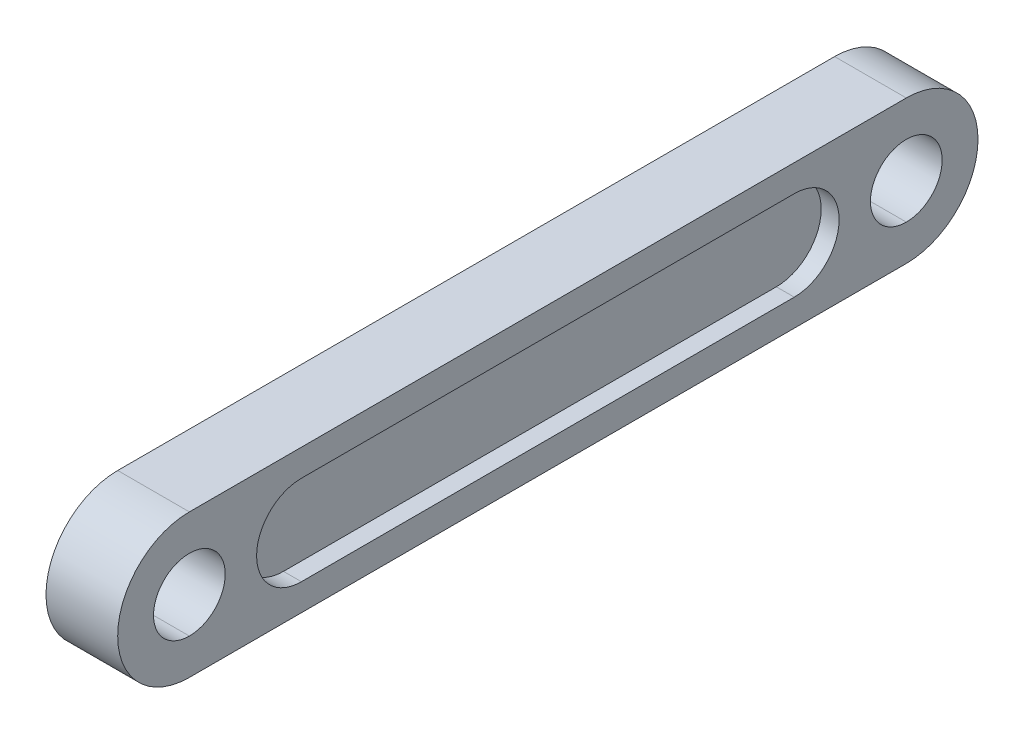
ISO-10303-21;
HEADER;
FILE_DESCRIPTION(('STEP AP214'),'2;1');
FILE_NAME('part.step','',(''),(''),'','','');
FILE_SCHEMA(('AUTOMOTIVE_DESIGN { 1 0 10303 214 1 1 1 1 }'));
ENDSEC;
DATA;
#1=APPLICATION_CONTEXT('core data for automotive mechanical design processes');
#2=APPLICATION_PROTOCOL_DEFINITION('international standard','automotive_design',2000,#1);
#3=PRODUCT_CONTEXT('',#1,'mechanical');
#4=PRODUCT('Part','Part','',(#3));
#5=PRODUCT_RELATED_PRODUCT_CATEGORY('part','',(#4));
#6=PRODUCT_DEFINITION_FORMATION('','',#4);
#7=PRODUCT_DEFINITION_CONTEXT('part definition',#1,'design');
#8=PRODUCT_DEFINITION('design','',#6,#7);
#9=PRODUCT_DEFINITION_SHAPE('','',#8);
#10=(LENGTH_UNIT() NAMED_UNIT(*) SI_UNIT(.MILLI.,.METRE.));
#11=(NAMED_UNIT(*) PLANE_ANGLE_UNIT() SI_UNIT($,.RADIAN.));
#12=(NAMED_UNIT(*) SI_UNIT($,.STERADIAN.) SOLID_ANGLE_UNIT());
#13=UNCERTAINTY_MEASURE_WITH_UNIT(LENGTH_MEASURE(1.E-05),#10,'distance_accuracy_value','');
#14=(GEOMETRIC_REPRESENTATION_CONTEXT(3) GLOBAL_UNCERTAINTY_ASSIGNED_CONTEXT((#13)) GLOBAL_UNIT_ASSIGNED_CONTEXT((#10,
#11,#12)) REPRESENTATION_CONTEXT('',''));
#15=CARTESIAN_POINT('',(0.,0.,0.));
#16=DIRECTION('',(0.,0.,1.));
#17=DIRECTION('',(1.,0.,0.));
#18=AXIS2_PLACEMENT_3D('',#15,#16,#17);
#19=CARTESIAN_POINT('',(4.,0.,0.));
#20=DIRECTION('',(1.,0.,0.));
#21=DIRECTION('',(0.,0.,-1.));
#22=AXIS2_PLACEMENT_3D('',#19,#20,#21);
#23=PLANE('',#22);
#24=CARTESIAN_POINT('',(4.,0.,-40.));
#25=DIRECTION('',(1.,0.,0.));
#26=DIRECTION('',(0.,0.,-1.));
#27=AXIS2_PLACEMENT_3D('',#24,#25,#26);
#28=CIRCLE('',#27,4.00000000000001);
#29=CARTESIAN_POINT('',(4.,4.00000000000001,-40.));
#30=VERTEX_POINT('',#29);
#31=CARTESIAN_POINT('',(4.,-4.,-40.));
#32=VERTEX_POINT('',#31);
#33=EDGE_CURVE('E222',#30,#32,#28,.F.);
#34=ORIENTED_EDGE('',*,*,#33,.T.);
#35=EDGE_CURVE('E226',#32,#30,#28,.F.);
#36=ORIENTED_EDGE('',*,*,#35,.T.);
#37=EDGE_LOOP('',(#34,#36));
#38=FACE_BOUND('',#37,.T.);
#39=CARTESIAN_POINT('',(4.,0.,40.));
#40=DIRECTION('',(1.,0.,0.));
#41=DIRECTION('',(0.,0.,-1.));
#42=AXIS2_PLACEMENT_3D('',#39,#40,#41);
#43=CIRCLE('',#42,4.00000000000001);
#44=CARTESIAN_POINT('',(4.,4.,40.));
#45=VERTEX_POINT('',#44);
#46=CARTESIAN_POINT('',(4.,-4.00000000000001,40.));
#47=VERTEX_POINT('',#46);
#48=EDGE_CURVE('E227',#45,#47,#43,.T.);
#49=ORIENTED_EDGE('',*,*,#48,.F.);
#50=EDGE_CURVE('E225',#47,#45,#43,.T.);
#51=ORIENTED_EDGE('',*,*,#50,.F.);
#52=EDGE_LOOP('',(#49,#51));
#53=FACE_BOUND('',#52,.T.);
#54=DIRECTION('',(0.,0.,-1.));
#55=VECTOR('',#54,1.);
#56=CARTESIAN_POINT('',(4.,-7.99999999999999,0.));
#57=LINE('',#56,#55);
#58=CARTESIAN_POINT('',(4.,-7.99999999999999,40.));
#59=VERTEX_POINT('',#58);
#60=CARTESIAN_POINT('',(4.,-7.99999999999999,-40.));
#61=VERTEX_POINT('',#60);
#62=EDGE_CURVE('E230',#59,#61,#57,.T.);
#63=ORIENTED_EDGE('',*,*,#62,.T.);
#64=CARTESIAN_POINT('',(4.,0.,-40.));
#65=DIRECTION('',(1.,0.,0.));
#66=DIRECTION('',(0.,0.,-1.));
#67=AXIS2_PLACEMENT_3D('',#64,#65,#66);
#68=CIRCLE('',#67,7.99999999999999);
#69=CARTESIAN_POINT('',(4.,7.99999999999998,-40.));
#70=VERTEX_POINT('',#69);
#71=EDGE_CURVE('E233',#61,#70,#68,.T.);
#72=ORIENTED_EDGE('',*,*,#71,.T.);
#73=DIRECTION('',(0.,0.,-1.));
#74=VECTOR('',#73,1.);
#75=CARTESIAN_POINT('',(4.,7.99999999999998,0.));
#76=LINE('',#75,#74);
#77=CARTESIAN_POINT('',(4.,7.99999999999998,40.));
#78=VERTEX_POINT('',#77);
#79=EDGE_CURVE('E235',#78,#70,#76,.T.);
#80=ORIENTED_EDGE('',*,*,#79,.F.);
#81=CARTESIAN_POINT('',(4.,0.,40.));
#82=DIRECTION('',(1.,0.,0.));
#83=DIRECTION('',(0.,0.,-1.));
#84=AXIS2_PLACEMENT_3D('',#81,#82,#83);
#85=CIRCLE('',#84,7.99999999999999);
#86=EDGE_CURVE('E238',#59,#78,#85,.F.);
#87=ORIENTED_EDGE('',*,*,#86,.F.);
#88=EDGE_LOOP('',(#63,#72,#80,#87));
#89=FACE_BOUND('',#88,.T.);
#90=DIRECTION('',(0.,0.,-1.));
#91=VECTOR('',#90,1.);
#92=CARTESIAN_POINT('',(4.,5.,-27.5));
#93=LINE('',#92,#91);
#94=CARTESIAN_POINT('',(4.,5.,27.5));
#95=VERTEX_POINT('',#94);
#96=CARTESIAN_POINT('',(4.,5.,-27.5));
#97=VERTEX_POINT('',#96);
#98=EDGE_CURVE('E182',#95,#97,#93,.T.);
#99=ORIENTED_EDGE('',*,*,#98,.T.);
#100=CARTESIAN_POINT('',(4.,0.,-27.5));
#101=DIRECTION('',(-1.,0.,0.));
#102=DIRECTION('',(0.,0.,1.));
#103=AXIS2_PLACEMENT_3D('',#100,#101,#102);
#104=CIRCLE('',#103,5.);
#105=CARTESIAN_POINT('',(4.,-5.,-27.5));
#106=VERTEX_POINT('',#105);
#107=EDGE_CURVE('E56',#97,#106,#104,.T.);
#108=ORIENTED_EDGE('',*,*,#107,.T.);
#109=DIRECTION('',(0.,0.,1.));
#110=VECTOR('',#109,1.);
#111=CARTESIAN_POINT('',(4.,-5.,-27.5));
#112=LINE('',#111,#110);
#113=CARTESIAN_POINT('',(4.,-4.99999999999999,27.5));
#114=VERTEX_POINT('',#113);
#115=EDGE_CURVE('E173',#106,#114,#112,.T.);
#116=ORIENTED_EDGE('',*,*,#115,.T.);
#117=CARTESIAN_POINT('',(4.,0.,27.5));
#118=DIRECTION('',(-1.,0.,0.));
#119=DIRECTION('',(0.,0.,1.));
#120=AXIS2_PLACEMENT_3D('',#117,#118,#119);
#121=CIRCLE('',#120,5.);
#122=EDGE_CURVE('E176',#114,#95,#121,.T.);
#123=ORIENTED_EDGE('',*,*,#122,.T.);
#124=EDGE_LOOP('',(#99,#108,#116,#123));
#125=FACE_BOUND('',#124,.T.);
#126=ADVANCED_FACE('F40',(#38,#53,#89,#125),#23,.T.);
#127=CARTESIAN_POINT('',(4.,0.,40.));
#128=DIRECTION('',(-1.,0.,0.));
#129=DIRECTION('',(0.,0.,1.));
#130=AXIS2_PLACEMENT_3D('',#127,#128,#129);
#131=CYLINDRICAL_SURFACE('',#130,4.00000000000001);
#132=ORIENTED_EDGE('',*,*,#48,.T.);
#133=DIRECTION('',(-1.,0.,0.));
#134=VECTOR('',#133,1.);
#135=CARTESIAN_POINT('',(4.,-4.00000000000001,40.));
#136=LINE('',#135,#134);
#137=CARTESIAN_POINT('',(-4.,-4.00000000000001,40.));
#138=VERTEX_POINT('',#137);
#139=EDGE_CURVE('E11',#47,#138,#136,.T.);
#140=ORIENTED_EDGE('',*,*,#139,.T.);
#141=CARTESIAN_POINT('',(-4.,0.,40.));
#142=DIRECTION('',(1.,0.,0.));
#143=DIRECTION('',(0.,0.,-1.));
#144=AXIS2_PLACEMENT_3D('',#141,#142,#143);
#145=CIRCLE('',#144,4.00000000000001);
#146=CARTESIAN_POINT('',(-4.,4.,40.));
#147=VERTEX_POINT('',#146);
#148=EDGE_CURVE('E246',#147,#138,#145,.T.);
#149=ORIENTED_EDGE('',*,*,#148,.F.);
#150=DIRECTION('',(-1.,0.,0.));
#151=VECTOR('',#150,1.);
#152=CARTESIAN_POINT('',(4.,4.,40.));
#153=LINE('',#152,#151);
#154=EDGE_CURVE('E49',#45,#147,#153,.T.);
#155=ORIENTED_EDGE('',*,*,#154,.F.);
#156=EDGE_LOOP('',(#132,#140,#149,#155));
#157=FACE_BOUND('',#156,.T.);
#158=ADVANCED_FACE('F287',(#157),#131,.F.);
#159=CARTESIAN_POINT('',(4.,0.,-40.));
#160=DIRECTION('',(-1.,0.,0.));
#161=DIRECTION('',(0.,0.,1.));
#162=AXIS2_PLACEMENT_3D('',#159,#160,#161);
#163=CYLINDRICAL_SURFACE('',#162,4.00000000000001);
#164=DIRECTION('',(-1.,0.,0.));
#165=VECTOR('',#164,1.);
#166=CARTESIAN_POINT('',(4.,-4.,-40.));
#167=LINE('',#166,#165);
#168=CARTESIAN_POINT('',(-4.,-4.,-40.));
#169=VERTEX_POINT('',#168);
#170=EDGE_CURVE('E273',#169,#32,#167,.F.);
#171=ORIENTED_EDGE('',*,*,#170,.F.);
#172=CARTESIAN_POINT('',(-4.,0.,-40.));
#173=DIRECTION('',(1.,0.,0.));
#174=DIRECTION('',(0.,0.,-1.));
#175=AXIS2_PLACEMENT_3D('',#172,#173,#174);
#176=CIRCLE('',#175,4.00000000000001);
#177=CARTESIAN_POINT('',(-4.,4.00000000000001,-40.));
#178=VERTEX_POINT('',#177);
#179=EDGE_CURVE('E216',#169,#178,#176,.F.);
#180=ORIENTED_EDGE('',*,*,#179,.T.);
#181=DIRECTION('',(-1.,0.,0.));
#182=VECTOR('',#181,1.);
#183=CARTESIAN_POINT('',(4.,4.00000000000001,-40.));
#184=LINE('',#183,#182);
#185=EDGE_CURVE('E269',#178,#30,#184,.F.);
#186=ORIENTED_EDGE('',*,*,#185,.T.);
#187=ORIENTED_EDGE('',*,*,#35,.F.);
#188=EDGE_LOOP('',(#171,#180,#186,#187));
#189=FACE_BOUND('',#188,.T.);
#190=ADVANCED_FACE('F359',(#189),#163,.F.);
#191=CARTESIAN_POINT('',(4.,-7.99999999999999,0.));
#192=DIRECTION('',(0.,1.,0.));
#193=DIRECTION('',(0.,0.,1.));
#194=AXIS2_PLACEMENT_3D('',#191,#192,#193);
#195=PLANE('',#194);
#196=DIRECTION('',(0.,0.,-1.));
#197=VECTOR('',#196,1.);
#198=CARTESIAN_POINT('',(-4.,-7.99999999999999,0.));
#199=LINE('',#198,#197);
#200=CARTESIAN_POINT('',(-4.,-7.99999999999999,40.));
#201=VERTEX_POINT('',#200);
#202=CARTESIAN_POINT('',(-4.,-7.99999999999999,-40.));
#203=VERTEX_POINT('',#202);
#204=EDGE_CURVE('E249',#201,#203,#199,.T.);
#205=ORIENTED_EDGE('',*,*,#204,.T.);
#206=DIRECTION('',(-1.,0.,0.));
#207=VECTOR('',#206,1.);
#208=CARTESIAN_POINT('',(4.,-7.99999999999999,-40.));
#209=LINE('',#208,#207);
#210=EDGE_CURVE('E266',#61,#203,#209,.T.);
#211=ORIENTED_EDGE('',*,*,#210,.F.);
#212=ORIENTED_EDGE('',*,*,#62,.F.);
#213=DIRECTION('',(-1.,0.,0.));
#214=VECTOR('',#213,1.);
#215=CARTESIAN_POINT('',(4.,-7.99999999999999,40.));
#216=LINE('',#215,#214);
#217=EDGE_CURVE('E241',#59,#201,#216,.T.);
#218=ORIENTED_EDGE('',*,*,#217,.T.);
#219=EDGE_LOOP('',(#205,#211,#212,#218));
#220=FACE_BOUND('',#219,.T.);
#221=ADVANCED_FACE('F310',(#220),#195,.F.);
#222=CARTESIAN_POINT('',(4.,0.,-40.));
#223=DIRECTION('',(-1.,0.,0.));
#224=DIRECTION('',(0.,0.,1.));
#225=AXIS2_PLACEMENT_3D('',#222,#223,#224);
#226=CYLINDRICAL_SURFACE('',#225,7.99999999999999);
#227=CARTESIAN_POINT('',(-4.,0.,-40.));
#228=DIRECTION('',(1.,0.,0.));
#229=DIRECTION('',(0.,0.,-1.));
#230=AXIS2_PLACEMENT_3D('',#227,#228,#229);
#231=CIRCLE('',#230,7.99999999999999);
#232=CARTESIAN_POINT('',(-4.,7.99999999999998,-40.));
#233=VERTEX_POINT('',#232);
#234=EDGE_CURVE('E252',#203,#233,#231,.T.);
#235=ORIENTED_EDGE('',*,*,#234,.T.);
#236=DIRECTION('',(-1.,0.,0.));
#237=VECTOR('',#236,1.);
#238=CARTESIAN_POINT('',(4.,7.99999999999998,-40.));
#239=LINE('',#238,#237);
#240=EDGE_CURVE('E264',#70,#233,#239,.T.);
#241=ORIENTED_EDGE('',*,*,#240,.F.);
#242=ORIENTED_EDGE('',*,*,#71,.F.);
#243=ORIENTED_EDGE('',*,*,#210,.T.);
#244=EDGE_LOOP('',(#235,#241,#242,#243));
#245=FACE_BOUND('',#244,.T.);
#246=ADVANCED_FACE('F309',(#245),#226,.T.);
#247=CARTESIAN_POINT('',(4.,7.99999999999998,0.));
#248=DIRECTION('',(0.,1.,0.));
#249=DIRECTION('',(0.,0.,1.));
#250=AXIS2_PLACEMENT_3D('',#247,#248,#249);
#251=PLANE('',#250);
#252=DIRECTION('',(0.,0.,-1.));
#253=VECTOR('',#252,1.);
#254=CARTESIAN_POINT('',(-4.,7.99999999999998,0.));
#255=LINE('',#254,#253);
#256=CARTESIAN_POINT('',(-4.,7.99999999999998,40.));
#257=VERTEX_POINT('',#256);
#258=EDGE_CURVE('E255',#257,#233,#255,.T.);
#259=ORIENTED_EDGE('',*,*,#258,.F.);
#260=DIRECTION('',(-1.,0.,0.));
#261=VECTOR('',#260,1.);
#262=CARTESIAN_POINT('',(4.,7.99999999999998,40.));
#263=LINE('',#262,#261);
#264=EDGE_CURVE('E262',#78,#257,#263,.T.);
#265=ORIENTED_EDGE('',*,*,#264,.F.);
#266=ORIENTED_EDGE('',*,*,#79,.T.);
#267=ORIENTED_EDGE('',*,*,#240,.T.);
#268=EDGE_LOOP('',(#259,#265,#266,#267));
#269=FACE_BOUND('',#268,.T.);
#270=ADVANCED_FACE('F306',(#269),#251,.T.);
#271=ORIENTED_EDGE('',*,*,#139,.F.);
#272=ORIENTED_EDGE('',*,*,#50,.T.);
#273=ORIENTED_EDGE('',*,*,#154,.T.);
#274=EDGE_CURVE('E245',#138,#147,#145,.T.);
#275=ORIENTED_EDGE('',*,*,#274,.F.);
#276=EDGE_LOOP('',(#271,#272,#273,#275));
#277=FACE_BOUND('',#276,.T.);
#278=ADVANCED_FACE('F283',(#277),#131,.F.);
#279=EDGE_CURVE('E242',#178,#169,#176,.F.);
#280=ORIENTED_EDGE('',*,*,#279,.T.);
#281=ORIENTED_EDGE('',*,*,#170,.T.);
#282=ORIENTED_EDGE('',*,*,#33,.F.);
#283=ORIENTED_EDGE('',*,*,#185,.F.);
#284=EDGE_LOOP('',(#280,#281,#282,#283));
#285=FACE_BOUND('',#284,.T.);
#286=ADVANCED_FACE('F42',(#285),#163,.F.);
#287=CARTESIAN_POINT('',(4.,0.,40.));
#288=DIRECTION('',(-1.,0.,0.));
#289=DIRECTION('',(0.,0.,1.));
#290=AXIS2_PLACEMENT_3D('',#287,#288,#289);
#291=CYLINDRICAL_SURFACE('',#290,7.99999999999999);
#292=CARTESIAN_POINT('',(-4.,0.,40.));
#293=DIRECTION('',(1.,0.,0.));
#294=DIRECTION('',(0.,0.,-1.));
#295=AXIS2_PLACEMENT_3D('',#292,#293,#294);
#296=CIRCLE('',#295,7.99999999999999);
#297=EDGE_CURVE('E258',#201,#257,#296,.F.);
#298=ORIENTED_EDGE('',*,*,#297,.F.);
#299=ORIENTED_EDGE('',*,*,#217,.F.);
#300=ORIENTED_EDGE('',*,*,#86,.T.);
#301=ORIENTED_EDGE('',*,*,#264,.T.);
#302=EDGE_LOOP('',(#298,#299,#300,#301));
#303=FACE_BOUND('',#302,.T.);
#304=ADVANCED_FACE('F293',(#303),#291,.T.);
#305=CARTESIAN_POINT('',(-4.,0.,0.));
#306=DIRECTION('',(1.,0.,0.));
#307=DIRECTION('',(0.,0.,-1.));
#308=AXIS2_PLACEMENT_3D('',#305,#306,#307);
#309=PLANE('',#308);
#310=DIRECTION('',(0.,0.,1.));
#311=VECTOR('',#310,1.);
#312=CARTESIAN_POINT('',(-4.,-5.,-27.5));
#313=LINE('',#312,#311);
#314=CARTESIAN_POINT('',(-4.,-5.,-27.5));
#315=VERTEX_POINT('',#314);
#316=CARTESIAN_POINT('',(-4.,-4.99999999999999,27.5));
#317=VERTEX_POINT('',#316);
#318=EDGE_CURVE('E206',#315,#317,#313,.T.);
#319=ORIENTED_EDGE('',*,*,#318,.F.);
#320=CARTESIAN_POINT('',(-4.,0.,-27.5));
#321=DIRECTION('',(-1.,0.,0.));
#322=DIRECTION('',(0.,0.,1.));
#323=AXIS2_PLACEMENT_3D('',#320,#321,#322);
#324=CIRCLE('',#323,5.);
#325=CARTESIAN_POINT('',(-4.,5.,-27.5));
#326=VERTEX_POINT('',#325);
#327=EDGE_CURVE('E64',#326,#315,#324,.T.);
#328=ORIENTED_EDGE('',*,*,#327,.F.);
#329=DIRECTION('',(0.,0.,-1.));
#330=VECTOR('',#329,1.);
#331=CARTESIAN_POINT('',(-4.,5.,-27.5));
#332=LINE('',#331,#330);
#333=CARTESIAN_POINT('',(-4.,5.,27.5));
#334=VERTEX_POINT('',#333);
#335=EDGE_CURVE('E195',#334,#326,#332,.T.);
#336=ORIENTED_EDGE('',*,*,#335,.F.);
#337=CARTESIAN_POINT('',(-4.,0.,27.5));
#338=DIRECTION('',(-1.,0.,0.));
#339=DIRECTION('',(0.,0.,1.));
#340=AXIS2_PLACEMENT_3D('',#337,#338,#339);
#341=CIRCLE('',#340,5.);
#342=EDGE_CURVE('E209',#317,#334,#341,.T.);
#343=ORIENTED_EDGE('',*,*,#342,.F.);
#344=EDGE_LOOP('',(#319,#328,#336,#343));
#345=FACE_BOUND('',#344,.T.);
#346=ORIENTED_EDGE('',*,*,#279,.F.);
#347=ORIENTED_EDGE('',*,*,#179,.F.);
#348=EDGE_LOOP('',(#346,#347));
#349=FACE_BOUND('',#348,.T.);
#350=ORIENTED_EDGE('',*,*,#148,.T.);
#351=ORIENTED_EDGE('',*,*,#274,.T.);
#352=EDGE_LOOP('',(#350,#351));
#353=FACE_BOUND('',#352,.T.);
#354=ORIENTED_EDGE('',*,*,#204,.F.);
#355=ORIENTED_EDGE('',*,*,#297,.T.);
#356=ORIENTED_EDGE('',*,*,#258,.T.);
#357=ORIENTED_EDGE('',*,*,#234,.F.);
#358=EDGE_LOOP('',(#354,#355,#356,#357));
#359=FACE_BOUND('',#358,.T.);
#360=ADVANCED_FACE('F289',(#345,#349,#353,#359),#309,.F.);
#361=CARTESIAN_POINT('',(-2.,0.,-27.5));
#362=DIRECTION('',(-1.,0.,0.));
#363=DIRECTION('',(0.,0.,1.));
#364=AXIS2_PLACEMENT_3D('',#361,#362,#363);
#365=CYLINDRICAL_SURFACE('',#364,5.);
#366=ORIENTED_EDGE('',*,*,#327,.T.);
#367=DIRECTION('',(-1.,0.,0.));
#368=VECTOR('',#367,1.);
#369=CARTESIAN_POINT('',(-2.,-5.,-27.5));
#370=LINE('',#369,#368);
#371=CARTESIAN_POINT('',(-2.,-5.,-27.5));
#372=VERTEX_POINT('',#371);
#373=EDGE_CURVE('E204',#372,#315,#370,.T.);
#374=ORIENTED_EDGE('',*,*,#373,.F.);
#375=CARTESIAN_POINT('',(-2.,0.,-27.5));
#376=DIRECTION('',(-1.,0.,0.));
#377=DIRECTION('',(0.,0.,1.));
#378=AXIS2_PLACEMENT_3D('',#375,#376,#377);
#379=CIRCLE('',#378,5.);
#380=CARTESIAN_POINT('',(-2.,5.,-27.5));
#381=VERTEX_POINT('',#380);
#382=EDGE_CURVE('E191',#381,#372,#379,.T.);
#383=ORIENTED_EDGE('',*,*,#382,.F.);
#384=DIRECTION('',(-1.,0.,0.));
#385=VECTOR('',#384,1.);
#386=CARTESIAN_POINT('',(-2.,5.,-27.5));
#387=LINE('',#386,#385);
#388=EDGE_CURVE('E214',#381,#326,#387,.T.);
#389=ORIENTED_EDGE('',*,*,#388,.T.);
#390=EDGE_LOOP('',(#366,#374,#383,#389));
#391=FACE_BOUND('',#390,.T.);
#392=ADVANCED_FACE('F292',(#391),#365,.F.);
#393=CARTESIAN_POINT('',(-2.,5.,-27.5));
#394=DIRECTION('',(0.,1.,0.));
#395=DIRECTION('',(0.,0.,1.));
#396=AXIS2_PLACEMENT_3D('',#393,#394,#395);
#397=PLANE('',#396);
#398=ORIENTED_EDGE('',*,*,#335,.T.);
#399=ORIENTED_EDGE('',*,*,#388,.F.);
#400=DIRECTION('',(0.,0.,-1.));
#401=VECTOR('',#400,1.);
#402=CARTESIAN_POINT('',(-2.,5.,-27.5));
#403=LINE('',#402,#401);
#404=CARTESIAN_POINT('',(-2.,5.,27.5));
#405=VERTEX_POINT('',#404);
#406=EDGE_CURVE('E201',#405,#381,#403,.T.);
#407=ORIENTED_EDGE('',*,*,#406,.F.);
#408=DIRECTION('',(-1.,0.,0.));
#409=VECTOR('',#408,1.);
#410=CARTESIAN_POINT('',(-2.,5.,27.5));
#411=LINE('',#410,#409);
#412=EDGE_CURVE('E217',#405,#334,#411,.T.);
#413=ORIENTED_EDGE('',*,*,#412,.T.);
#414=EDGE_LOOP('',(#398,#399,#407,#413));
#415=FACE_BOUND('',#414,.T.);
#416=ADVANCED_FACE('F339',(#415),#397,.F.);
#417=CARTESIAN_POINT('',(-2.,0.,27.5));
#418=DIRECTION('',(-1.,0.,0.));
#419=DIRECTION('',(0.,0.,1.));
#420=AXIS2_PLACEMENT_3D('',#417,#418,#419);
#421=CYLINDRICAL_SURFACE('',#420,5.);
#422=ORIENTED_EDGE('',*,*,#342,.T.);
#423=ORIENTED_EDGE('',*,*,#412,.F.);
#424=CARTESIAN_POINT('',(-2.,0.,27.5));
#425=DIRECTION('',(-1.,0.,0.));
#426=DIRECTION('',(0.,0.,1.));
#427=AXIS2_PLACEMENT_3D('',#424,#425,#426);
#428=CIRCLE('',#427,5.);
#429=CARTESIAN_POINT('',(-2.,-4.99999999999999,27.5));
#430=VERTEX_POINT('',#429);
#431=EDGE_CURVE('E198',#430,#405,#428,.T.);
#432=ORIENTED_EDGE('',*,*,#431,.F.);
#433=DIRECTION('',(-1.,0.,0.));
#434=VECTOR('',#433,1.);
#435=CARTESIAN_POINT('',(-2.,-4.99999999999999,27.5));
#436=LINE('',#435,#434);
#437=EDGE_CURVE('E219',#430,#317,#436,.T.);
#438=ORIENTED_EDGE('',*,*,#437,.T.);
#439=EDGE_LOOP('',(#422,#423,#432,#438));
#440=FACE_BOUND('',#439,.T.);
#441=ADVANCED_FACE('F342',(#440),#421,.F.);
#442=CARTESIAN_POINT('',(-2.,-5.,-27.5));
#443=DIRECTION('',(0.,-1.,0.));
#444=DIRECTION('',(0.,0.,-1.));
#445=AXIS2_PLACEMENT_3D('',#442,#443,#444);
#446=PLANE('',#445);
#447=ORIENTED_EDGE('',*,*,#318,.T.);
#448=ORIENTED_EDGE('',*,*,#437,.F.);
#449=DIRECTION('',(0.,0.,1.));
#450=VECTOR('',#449,1.);
#451=CARTESIAN_POINT('',(-2.,-5.,-27.5));
#452=LINE('',#451,#450);
#453=EDGE_CURVE('E194',#372,#430,#452,.T.);
#454=ORIENTED_EDGE('',*,*,#453,.F.);
#455=ORIENTED_EDGE('',*,*,#373,.T.);
#456=EDGE_LOOP('',(#447,#448,#454,#455));
#457=FACE_BOUND('',#456,.T.);
#458=ADVANCED_FACE('F337',(#457),#446,.F.);
#459=CARTESIAN_POINT('',(-2.,0.,-27.5));
#460=DIRECTION('',(-1.,0.,0.));
#461=DIRECTION('',(0.,0.,1.));
#462=AXIS2_PLACEMENT_3D('',#459,#460,#461);
#463=PLANE('',#462);
#464=ORIENTED_EDGE('',*,*,#382,.T.);
#465=ORIENTED_EDGE('',*,*,#453,.T.);
#466=ORIENTED_EDGE('',*,*,#431,.T.);
#467=ORIENTED_EDGE('',*,*,#406,.T.);
#468=EDGE_LOOP('',(#464,#465,#466,#467));
#469=FACE_BOUND('',#468,.T.);
#470=ADVANCED_FACE('F329',(#469),#463,.T.);
#471=CARTESIAN_POINT('',(2.,0.,-27.5));
#472=DIRECTION('',(1.,0.,0.));
#473=DIRECTION('',(0.,0.,-1.));
#474=AXIS2_PLACEMENT_3D('',#471,#472,#473);
#475=CYLINDRICAL_SURFACE('',#474,5.);
#476=ORIENTED_EDGE('',*,*,#107,.F.);
#477=DIRECTION('',(1.,0.,0.));
#478=VECTOR('',#477,1.);
#479=CARTESIAN_POINT('',(2.,5.,-27.5));
#480=LINE('',#479,#478);
#481=CARTESIAN_POINT('',(2.,5.,-27.5));
#482=VERTEX_POINT('',#481);
#483=EDGE_CURVE('E158',#482,#97,#480,.T.);
#484=ORIENTED_EDGE('',*,*,#483,.F.);
#485=CARTESIAN_POINT('',(2.,0.,-27.5));
#486=DIRECTION('',(-1.,0.,0.));
#487=DIRECTION('',(0.,0.,1.));
#488=AXIS2_PLACEMENT_3D('',#485,#486,#487);
#489=CIRCLE('',#488,5.);
#490=CARTESIAN_POINT('',(2.,-5.,-27.5));
#491=VERTEX_POINT('',#490);
#492=EDGE_CURVE('E165',#482,#491,#489,.T.);
#493=ORIENTED_EDGE('',*,*,#492,.T.);
#494=DIRECTION('',(1.,0.,0.));
#495=VECTOR('',#494,1.);
#496=CARTESIAN_POINT('',(2.,-5.,-27.5));
#497=LINE('',#496,#495);
#498=EDGE_CURVE('E186',#491,#106,#497,.T.);
#499=ORIENTED_EDGE('',*,*,#498,.T.);
#500=EDGE_LOOP('',(#476,#484,#493,#499));
#501=FACE_BOUND('',#500,.T.);
#502=ADVANCED_FACE('F168',(#501),#475,.F.);
#503=CARTESIAN_POINT('',(2.,-5.,-27.5));
#504=DIRECTION('',(0.,1.,0.));
#505=DIRECTION('',(0.,0.,1.));
#506=AXIS2_PLACEMENT_3D('',#503,#504,#505);
#507=PLANE('',#506);
#508=ORIENTED_EDGE('',*,*,#115,.F.);
#509=ORIENTED_EDGE('',*,*,#498,.F.);
#510=DIRECTION('',(0.,0.,1.));
#511=VECTOR('',#510,1.);
#512=CARTESIAN_POINT('',(2.,-5.,-27.5));
#513=LINE('',#512,#511);
#514=CARTESIAN_POINT('',(2.,-4.99999999999999,27.5));
#515=VERTEX_POINT('',#514);
#516=EDGE_CURVE('E170',#491,#515,#513,.T.);
#517=ORIENTED_EDGE('',*,*,#516,.T.);
#518=DIRECTION('',(1.,0.,0.));
#519=VECTOR('',#518,1.);
#520=CARTESIAN_POINT('',(2.,-4.99999999999999,27.5));
#521=LINE('',#520,#519);
#522=EDGE_CURVE('E188',#515,#114,#521,.T.);
#523=ORIENTED_EDGE('',*,*,#522,.T.);
#524=EDGE_LOOP('',(#508,#509,#517,#523));
#525=FACE_BOUND('',#524,.T.);
#526=ADVANCED_FACE('F321',(#525),#507,.T.);
#527=CARTESIAN_POINT('',(2.,0.,27.5));
#528=DIRECTION('',(1.,0.,0.));
#529=DIRECTION('',(0.,0.,-1.));
#530=AXIS2_PLACEMENT_3D('',#527,#528,#529);
#531=CYLINDRICAL_SURFACE('',#530,5.);
#532=ORIENTED_EDGE('',*,*,#122,.F.);
#533=ORIENTED_EDGE('',*,*,#522,.F.);
#534=CARTESIAN_POINT('',(2.,0.,27.5));
#535=DIRECTION('',(-1.,0.,0.));
#536=DIRECTION('',(0.,0.,1.));
#537=AXIS2_PLACEMENT_3D('',#534,#535,#536);
#538=CIRCLE('',#537,5.);
#539=CARTESIAN_POINT('',(2.,5.,27.5));
#540=VERTEX_POINT('',#539);
#541=EDGE_CURVE('E164',#515,#540,#538,.T.);
#542=ORIENTED_EDGE('',*,*,#541,.T.);
#543=DIRECTION('',(1.,0.,0.));
#544=VECTOR('',#543,1.);
#545=CARTESIAN_POINT('',(2.,5.,27.5));
#546=LINE('',#545,#544);
#547=EDGE_CURVE('E160',#540,#95,#546,.T.);
#548=ORIENTED_EDGE('',*,*,#547,.T.);
#549=EDGE_LOOP('',(#532,#533,#542,#548));
#550=FACE_BOUND('',#549,.T.);
#551=ADVANCED_FACE('F319',(#550),#531,.F.);
#552=CARTESIAN_POINT('',(2.,5.,-27.5));
#553=DIRECTION('',(0.,-1.,0.));
#554=DIRECTION('',(0.,0.,-1.));
#555=AXIS2_PLACEMENT_3D('',#552,#553,#554);
#556=PLANE('',#555);
#557=ORIENTED_EDGE('',*,*,#98,.F.);
#558=ORIENTED_EDGE('',*,*,#547,.F.);
#559=DIRECTION('',(0.,0.,-1.));
#560=VECTOR('',#559,1.);
#561=CARTESIAN_POINT('',(2.,5.,-27.5));
#562=LINE('',#561,#560);
#563=EDGE_CURVE('E155',#540,#482,#562,.T.);
#564=ORIENTED_EDGE('',*,*,#563,.T.);
#565=ORIENTED_EDGE('',*,*,#483,.T.);
#566=EDGE_LOOP('',(#557,#558,#564,#565));
#567=FACE_BOUND('',#566,.T.);
#568=ADVANCED_FACE('F157',(#567),#556,.T.);
#569=CARTESIAN_POINT('',(2.,0.,-27.5));
#570=DIRECTION('',(1.,0.,0.));
#571=DIRECTION('',(0.,0.,1.));
#572=AXIS2_PLACEMENT_3D('',#569,#570,#571);
#573=PLANE('',#572);
#574=ORIENTED_EDGE('',*,*,#492,.F.);
#575=ORIENTED_EDGE('',*,*,#563,.F.);
#576=ORIENTED_EDGE('',*,*,#541,.F.);
#577=ORIENTED_EDGE('',*,*,#516,.F.);
#578=EDGE_LOOP('',(#574,#575,#576,#577));
#579=FACE_BOUND('',#578,.T.);
#580=ADVANCED_FACE('F172',(#579),#573,.T.);
#581=CLOSED_SHELL('',(#126,#158,#190,#221,#246,#270,#278,#286,#304,#360,#392,#416,#441,#458,
#470,#502,#526,#551,#568,#580));
#582=MANIFOLD_SOLID_BREP('B2',#581);
#583=ADVANCED_BREP_SHAPE_REPRESENTATION('',(#18,#582),#14);
#584=SHAPE_DEFINITION_REPRESENTATION(#9,#583);
ENDSEC;
END-ISO-10303-21;
